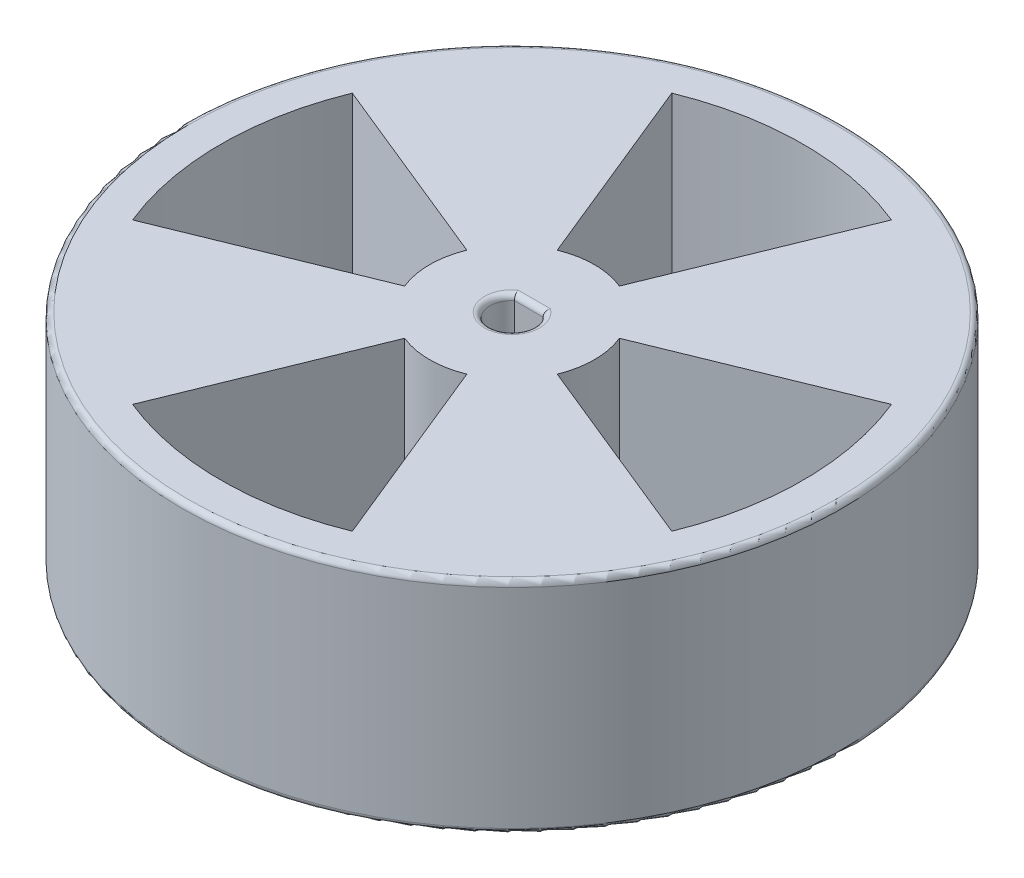
ISO-10303-21;
HEADER;
FILE_DESCRIPTION(('STEP AP214'),'2;1');
FILE_NAME('part.step','',(''),(''),'','','');
FILE_SCHEMA(('AUTOMOTIVE_DESIGN { 1 0 10303 214 1 1 1 1 }'));
ENDSEC;
DATA;
#1=APPLICATION_CONTEXT('core data for automotive mechanical design processes');
#2=APPLICATION_PROTOCOL_DEFINITION('international standard','automotive_design',2000,#1);
#3=PRODUCT_CONTEXT('',#1,'mechanical');
#4=PRODUCT('Part','Part','',(#3));
#5=PRODUCT_RELATED_PRODUCT_CATEGORY('part','',(#4));
#6=PRODUCT_DEFINITION_FORMATION('','',#4);
#7=PRODUCT_DEFINITION_CONTEXT('part definition',#1,'design');
#8=PRODUCT_DEFINITION('design','',#6,#7);
#9=PRODUCT_DEFINITION_SHAPE('','',#8);
#10=(LENGTH_UNIT() NAMED_UNIT(*) SI_UNIT(.MILLI.,.METRE.));
#11=(NAMED_UNIT(*) PLANE_ANGLE_UNIT() SI_UNIT($,.RADIAN.));
#12=(NAMED_UNIT(*) SI_UNIT($,.STERADIAN.) SOLID_ANGLE_UNIT());
#13=UNCERTAINTY_MEASURE_WITH_UNIT(LENGTH_MEASURE(1.E-05),#10,'distance_accuracy_value','');
#14=(GEOMETRIC_REPRESENTATION_CONTEXT(3) GLOBAL_UNCERTAINTY_ASSIGNED_CONTEXT((#13)) GLOBAL_UNIT_ASSIGNED_CONTEXT((#10,
#11,#12)) REPRESENTATION_CONTEXT('',''));
#15=CARTESIAN_POINT('',(0.,0.,0.));
#16=DIRECTION('',(0.,0.,1.));
#17=DIRECTION('',(1.,0.,0.));
#18=AXIS2_PLACEMENT_3D('',#15,#16,#17);
#19=CARTESIAN_POINT('',(0.,20.,0.));
#20=DIRECTION('',(0.,-1.,0.));
#21=DIRECTION('',(0.,0.,-1.));
#22=AXIS2_PLACEMENT_3D('',#19,#20,#21);
#23=CYLINDRICAL_SURFACE('',#22,2.);
#24=DIRECTION('',(0.,-1.,0.));
#25=VECTOR('',#24,1.);
#26=CARTESIAN_POINT('',(1.29999999999998,20.,-1.51986841535708));
#27=LINE('',#26,#25);
#28=CARTESIAN_POINT('',(1.29999999999998,19.5,-1.51986841535708));
#29=VERTEX_POINT('',#28);
#30=CARTESIAN_POINT('',(1.3,0.5,-1.51986841535706));
#31=VERTEX_POINT('',#30);
#32=EDGE_CURVE('E480',#29,#31,#27,.T.);
#33=ORIENTED_EDGE('',*,*,#32,.T.);
#34=CARTESIAN_POINT('',(0.,0.5,0.));
#35=DIRECTION('',(0.,1.,0.));
#36=DIRECTION('',(0.,0.,1.));
#37=AXIS2_PLACEMENT_3D('',#34,#35,#36);
#38=CIRCLE('',#37,2.);
#39=CARTESIAN_POINT('',(-1.3,0.5,-1.51986841535705));
#40=VERTEX_POINT('',#39);
#41=EDGE_CURVE('E14',#31,#40,#38,.F.);
#42=ORIENTED_EDGE('',*,*,#41,.T.);
#43=DIRECTION('',(0.,-1.,0.));
#44=VECTOR('',#43,1.);
#45=CARTESIAN_POINT('',(-1.30000000000002,20.,-1.51986841535706));
#46=LINE('',#45,#44);
#47=CARTESIAN_POINT('',(-1.30000000000002,19.5,-1.51986841535706));
#48=VERTEX_POINT('',#47);
#49=EDGE_CURVE('E484',#48,#40,#46,.T.);
#50=ORIENTED_EDGE('',*,*,#49,.F.);
#51=CARTESIAN_POINT('',(0.,19.5,0.));
#52=DIRECTION('',(0.,1.,0.));
#53=DIRECTION('',(0.,0.,1.));
#54=AXIS2_PLACEMENT_3D('',#51,#52,#53);
#55=CIRCLE('',#54,2.);
#56=EDGE_CURVE('E170',#48,#29,#55,.T.);
#57=ORIENTED_EDGE('',*,*,#56,.T.);
#58=EDGE_LOOP('',(#33,#42,#50,#57));
#59=FACE_BOUND('',#58,.T.);
#60=ADVANCED_FACE('F155',(#59),#23,.F.);
#61=CARTESIAN_POINT('',(0.,20.,-1.51986841535706));
#62=DIRECTION('',(0.,0.,-1.));
#63=DIRECTION('',(-1.,0.,0.));
#64=AXIS2_PLACEMENT_3D('',#61,#62,#63);
#65=PLANE('',#64);
#66=ORIENTED_EDGE('',*,*,#49,.T.);
#67=DIRECTION('',(1.,0.,0.));
#68=VECTOR('',#67,1.);
#69=CARTESIAN_POINT('',(0.,0.5,-1.51986841535705));
#70=LINE('',#69,#68);
#71=EDGE_CURVE('E522',#40,#31,#70,.T.);
#72=ORIENTED_EDGE('',*,*,#71,.T.);
#73=ORIENTED_EDGE('',*,*,#32,.F.);
#74=DIRECTION('',(1.,0.,0.));
#75=VECTOR('',#74,1.);
#76=CARTESIAN_POINT('',(-1.30000000000002,19.5,-1.51986841535706));
#77=LINE('',#76,#75);
#78=EDGE_CURVE('E519',#29,#48,#77,.F.);
#79=ORIENTED_EDGE('',*,*,#78,.T.);
#80=EDGE_LOOP('',(#66,#72,#73,#79));
#81=FACE_BOUND('',#80,.T.);
#82=ADVANCED_FACE('F585',(#81),#65,.F.);
#83=CARTESIAN_POINT('',(0.,20.,0.));
#84=DIRECTION('',(0.,-1.,0.));
#85=DIRECTION('',(0.,0.,-1.));
#86=AXIS2_PLACEMENT_3D('',#83,#84,#85);
#87=CYLINDRICAL_SURFACE('',#86,30.);
#88=CARTESIAN_POINT('',(0.,19.5,0.));
#89=DIRECTION('',(0.,1.,0.));
#90=DIRECTION('',(0.,0.,1.));
#91=AXIS2_PLACEMENT_3D('',#88,#89,#90);
#92=CIRCLE('',#91,30.);
#93=CARTESIAN_POINT('',(0.,19.5,30.));
#94=VERTEX_POINT('',#93);
#95=EDGE_CURVE('E504',#94,#94,#92,.F.);
#96=ORIENTED_EDGE('',*,*,#95,.T.);
#97=EDGE_LOOP('',(#96));
#98=FACE_BOUND('',#97,.T.);
#99=CARTESIAN_POINT('',(0.,0.5,0.));
#100=DIRECTION('',(0.,1.,0.));
#101=DIRECTION('',(0.,0.,1.));
#102=AXIS2_PLACEMENT_3D('',#99,#100,#101);
#103=CIRCLE('',#102,30.);
#104=CARTESIAN_POINT('',(0.,0.5,30.));
#105=VERTEX_POINT('',#104);
#106=EDGE_CURVE('E500',#105,#105,#103,.T.);
#107=ORIENTED_EDGE('',*,*,#106,.T.);
#108=EDGE_LOOP('',(#107));
#109=FACE_BOUND('',#108,.T.);
#110=ADVANCED_FACE('F575',(#98,#109),#87,.T.);
#111=CARTESIAN_POINT('',(0.,20.,0.));
#112=DIRECTION('',(0.,1.,0.));
#113=DIRECTION('',(0.,0.,1.));
#114=AXIS2_PLACEMENT_3D('',#111,#112,#113);
#115=PLANE('',#114);
#116=DIRECTION('',(-0.926067259759097,0.,-0.377358490566038));
#117=VECTOR('',#116,1.);
#118=CARTESIAN_POINT('',(0.,20.,0.));
#119=LINE('',#118,#117);
#120=CARTESIAN_POINT('',(-6.94550444819269,20.,-2.83018867924505));
#121=VERTEX_POINT('',#120);
#122=CARTESIAN_POINT('',(-24.5407823836161,20.,-9.99999999999998));
#123=VERTEX_POINT('',#122);
#124=EDGE_CURVE('E178',#121,#123,#119,.T.);
#125=ORIENTED_EDGE('',*,*,#124,.F.);
#126=CARTESIAN_POINT('',(0.,20.,0.));
#127=DIRECTION('',(0.,1.,0.));
#128=DIRECTION('',(0.,0.,1.));
#129=AXIS2_PLACEMENT_3D('',#126,#127,#128);
#130=CIRCLE('',#129,7.5);
#131=CARTESIAN_POINT('',(-6.94550444819269,20.,2.83018867924551));
#132=VERTEX_POINT('',#131);
#133=EDGE_CURVE('E359',#121,#132,#130,.T.);
#134=ORIENTED_EDGE('',*,*,#133,.T.);
#135=DIRECTION('',(0.926067259759097,0.,-0.377358490566038));
#136=VECTOR('',#135,1.);
#137=CARTESIAN_POINT('',(1.38777878078145E-13,20.,4.16333634234434E-13));
#138=LINE('',#137,#136);
#139=CARTESIAN_POINT('',(-24.5407823836155,20.,10.0000000000003));
#140=VERTEX_POINT('',#139);
#141=EDGE_CURVE('E378',#140,#132,#138,.T.);
#142=ORIENTED_EDGE('',*,*,#141,.F.);
#143=CARTESIAN_POINT('',(0.,20.,0.));
#144=DIRECTION('',(0.,1.,0.));
#145=DIRECTION('',(0.,0.,1.));
#146=AXIS2_PLACEMENT_3D('',#143,#144,#145);
#147=CIRCLE('',#146,26.5);
#148=EDGE_CURVE('E373',#123,#140,#147,.T.);
#149=ORIENTED_EDGE('',*,*,#148,.F.);
#150=EDGE_LOOP('',(#125,#134,#142,#149));
#151=FACE_BOUND('',#150,.T.);
#152=DIRECTION('',(0.926067259759097,0.,0.377358490566038));
#153=VECTOR('',#152,1.);
#154=CARTESIAN_POINT('',(2.08166817117217E-13,20.,-5.55111512312578E-13));
#155=LINE('',#154,#153);
#156=CARTESIAN_POINT('',(6.94550444819345,20.,2.83018867924473));
#157=VERTEX_POINT('',#156);
#158=CARTESIAN_POINT('',(24.5407823836163,20.,9.99999999999945));
#159=VERTEX_POINT('',#158);
#160=EDGE_CURVE('E186',#157,#159,#155,.T.);
#161=ORIENTED_EDGE('',*,*,#160,.F.);
#162=CARTESIAN_POINT('',(0.,20.,0.));
#163=DIRECTION('',(0.,1.,0.));
#164=DIRECTION('',(0.,0.,1.));
#165=AXIS2_PLACEMENT_3D('',#162,#163,#164);
#166=CIRCLE('',#165,7.5);
#167=CARTESIAN_POINT('',(6.94550444819345,20.,-2.83018867924585));
#168=VERTEX_POINT('',#167);
#169=EDGE_CURVE('E402',#157,#168,#166,.T.);
#170=ORIENTED_EDGE('',*,*,#169,.T.);
#171=DIRECTION('',(-0.926067259759097,0.,0.377358490566038));
#172=VECTOR('',#171,1.);
#173=CARTESIAN_POINT('',(-1.66533453693773E-13,20.,-3.88578058618805E-13));
#174=LINE('',#173,#172);
#175=CARTESIAN_POINT('',(24.5407823836163,20.,-10.0000000000006));
#176=VERTEX_POINT('',#175);
#177=EDGE_CURVE('E420',#176,#168,#174,.T.);
#178=ORIENTED_EDGE('',*,*,#177,.F.);
#179=CARTESIAN_POINT('',(0.,20.,0.));
#180=DIRECTION('',(0.,1.,0.));
#181=DIRECTION('',(0.,0.,1.));
#182=AXIS2_PLACEMENT_3D('',#179,#180,#181);
#183=CIRCLE('',#182,26.5);
#184=EDGE_CURVE('E416',#159,#176,#183,.T.);
#185=ORIENTED_EDGE('',*,*,#184,.F.);
#186=EDGE_LOOP('',(#161,#170,#178,#185));
#187=FACE_BOUND('',#186,.T.);
#188=DIRECTION('',(-0.377358490566038,0.,0.926067259759097));
#189=VECTOR('',#188,1.);
#190=CARTESIAN_POINT('',(5.62050406216485E-13,20.,2.28983498828939E-13));
#191=LINE('',#190,#189);
#192=CARTESIAN_POINT('',(-2.83018867924451,20.,6.9455044481929));
#193=VERTEX_POINT('',#192);
#194=CARTESIAN_POINT('',(-9.99999999999947,20.,24.5407823836163));
#195=VERTEX_POINT('',#194);
#196=EDGE_CURVE('E306',#193,#195,#191,.T.);
#197=ORIENTED_EDGE('',*,*,#196,.F.);
#198=CARTESIAN_POINT('',(0.,20.,0.));
#199=DIRECTION('',(0.,1.,0.));
#200=DIRECTION('',(0.,0.,1.));
#201=AXIS2_PLACEMENT_3D('',#198,#199,#200);
#202=CIRCLE('',#201,7.5);
#203=CARTESIAN_POINT('',(2.83018867924607,20.,6.9455044481929));
#204=VERTEX_POINT('',#203);
#205=EDGE_CURVE('E326',#193,#204,#202,.T.);
#206=ORIENTED_EDGE('',*,*,#205,.T.);
#207=DIRECTION('',(-0.377358490566038,0.,-0.926067259759097));
#208=VECTOR('',#207,1.);
#209=CARTESIAN_POINT('',(7.70217223333702E-13,20.,-3.19189119579733E-13));
#210=LINE('',#209,#208);
#211=CARTESIAN_POINT('',(10.0000000000008,20.,24.5407823836157));
#212=VERTEX_POINT('',#211);
#213=EDGE_CURVE('E331',#212,#204,#210,.T.);
#214=ORIENTED_EDGE('',*,*,#213,.F.);
#215=CARTESIAN_POINT('',(0.,20.,0.));
#216=DIRECTION('',(0.,1.,0.));
#217=DIRECTION('',(0.,0.,1.));
#218=AXIS2_PLACEMENT_3D('',#215,#216,#217);
#219=CIRCLE('',#218,26.5);
#220=EDGE_CURVE('E340',#195,#212,#219,.T.);
#221=ORIENTED_EDGE('',*,*,#220,.F.);
#222=EDGE_LOOP('',(#197,#206,#214,#221));
#223=FACE_BOUND('',#222,.T.);
#224=DIRECTION('',(0.377358490566038,0.,-0.926067259759097));
#225=VECTOR('',#224,1.);
#226=CARTESIAN_POINT('',(0.,20.,0.));
#227=LINE('',#226,#225);
#228=CARTESIAN_POINT('',(2.83018867924528,20.,-6.94550444819322));
#229=VERTEX_POINT('',#228);
#230=CARTESIAN_POINT('',(10.,20.,-24.5407823836161));
#231=VERTEX_POINT('',#230);
#232=EDGE_CURVE('E388',#229,#231,#227,.T.);
#233=ORIENTED_EDGE('',*,*,#232,.F.);
#234=CARTESIAN_POINT('',(0.,20.,0.));
#235=DIRECTION('',(0.,1.,0.));
#236=DIRECTION('',(0.,0.,1.));
#237=AXIS2_PLACEMENT_3D('',#234,#235,#236);
#238=CIRCLE('',#237,7.5);
#239=CARTESIAN_POINT('',(-2.83018867924531,20.,-6.94550444819322));
#240=VERTEX_POINT('',#239);
#241=EDGE_CURVE('E442',#229,#240,#238,.T.);
#242=ORIENTED_EDGE('',*,*,#241,.T.);
#243=DIRECTION('',(0.377358490566038,0.,0.926067259759097));
#244=VECTOR('',#243,1.);
#245=CARTESIAN_POINT('',(0.,20.,0.));
#246=LINE('',#245,#244);
#247=CARTESIAN_POINT('',(-10.,20.,-24.5407823836161));
#248=VERTEX_POINT('',#247);
#249=EDGE_CURVE('E460',#248,#240,#246,.T.);
#250=ORIENTED_EDGE('',*,*,#249,.F.);
#251=CARTESIAN_POINT('',(0.,20.,0.));
#252=DIRECTION('',(0.,1.,0.));
#253=DIRECTION('',(0.,0.,1.));
#254=AXIS2_PLACEMENT_3D('',#251,#252,#253);
#255=CIRCLE('',#254,26.5);
#256=EDGE_CURVE('E456',#231,#248,#255,.T.);
#257=ORIENTED_EDGE('',*,*,#256,.F.);
#258=EDGE_LOOP('',(#233,#242,#250,#257));
#259=FACE_BOUND('',#258,.T.);
#260=CARTESIAN_POINT('',(0.,20.,0.));
#261=DIRECTION('',(0.,1.,0.));
#262=DIRECTION('',(0.,0.,1.));
#263=AXIS2_PLACEMENT_3D('',#260,#261,#262);
#264=CIRCLE('',#263,29.5);
#265=CARTESIAN_POINT('',(0.,20.,29.5));
#266=VERTEX_POINT('',#265);
#267=EDGE_CURVE('E496',#266,#266,#264,.T.);
#268=ORIENTED_EDGE('',*,*,#267,.T.);
#269=EDGE_LOOP('',(#268));
#270=FACE_BOUND('',#269,.T.);
#271=DIRECTION('',(1.,0.,0.));
#272=VECTOR('',#271,1.);
#273=CARTESIAN_POINT('',(1.29999999999998,20.,-2.01986841535706));
#274=LINE('',#273,#272);
#275=CARTESIAN_POINT('',(-1.47313664832661,20.,-2.01986841535708));
#276=VERTEX_POINT('',#275);
#277=CARTESIAN_POINT('',(1.47313664832659,20.,-2.01986841535706));
#278=VERTEX_POINT('',#277);
#279=EDGE_CURVE('E489',#276,#278,#274,.T.);
#280=ORIENTED_EDGE('',*,*,#279,.T.);
#281=CARTESIAN_POINT('',(0.,20.,0.));
#282=DIRECTION('',(0.,1.,0.));
#283=DIRECTION('',(0.,0.,1.));
#284=AXIS2_PLACEMENT_3D('',#281,#282,#283);
#285=CIRCLE('',#284,2.5);
#286=EDGE_CURVE('E492',#278,#276,#285,.F.);
#287=ORIENTED_EDGE('',*,*,#286,.T.);
#288=EDGE_LOOP('',(#280,#287));
#289=FACE_BOUND('',#288,.T.);
#290=ADVANCED_FACE('F573',(#151,#187,#223,#259,#270,#289),#115,.T.);
#291=CARTESIAN_POINT('',(0.,0.,0.));
#292=DIRECTION('',(0.,1.,0.));
#293=DIRECTION('',(0.,0.,1.));
#294=AXIS2_PLACEMENT_3D('',#291,#292,#293);
#295=PLANE('',#294);
#296=CARTESIAN_POINT('',(0.,0.,0.));
#297=DIRECTION('',(0.,1.,0.));
#298=DIRECTION('',(0.,0.,1.));
#299=AXIS2_PLACEMENT_3D('',#296,#297,#298);
#300=CIRCLE('',#299,7.5);
#301=CARTESIAN_POINT('',(-6.94550444819267,0.,-2.83018867924505));
#302=VERTEX_POINT('',#301);
#303=CARTESIAN_POINT('',(-6.94550444819267,0.,2.83018867924552));
#304=VERTEX_POINT('',#303);
#305=EDGE_CURVE('E367',#302,#304,#300,.T.);
#306=ORIENTED_EDGE('',*,*,#305,.F.);
#307=DIRECTION('',(-0.926067259759097,0.,-0.377358490566038));
#308=VECTOR('',#307,1.);
#309=CARTESIAN_POINT('',(0.,0.,0.));
#310=LINE('',#309,#308);
#311=CARTESIAN_POINT('',(-24.5407823836155,0.,-9.99999999999978));
#312=VERTEX_POINT('',#311);
#313=EDGE_CURVE('E354',#302,#312,#310,.T.);
#314=ORIENTED_EDGE('',*,*,#313,.T.);
#315=CARTESIAN_POINT('',(0.,0.,0.));
#316=DIRECTION('',(0.,1.,0.));
#317=DIRECTION('',(0.,0.,1.));
#318=AXIS2_PLACEMENT_3D('',#315,#316,#317);
#319=CIRCLE('',#318,26.5);
#320=CARTESIAN_POINT('',(-24.5407823836159,0.,10.0000000000004));
#321=VERTEX_POINT('',#320);
#322=EDGE_CURVE('E358',#312,#321,#319,.T.);
#323=ORIENTED_EDGE('',*,*,#322,.T.);
#324=DIRECTION('',(0.926067259759097,0.,-0.377358490566038));
#325=VECTOR('',#324,1.);
#326=CARTESIAN_POINT('',(1.52655665885959E-13,0.,4.09394740330526E-13));
#327=LINE('',#326,#325);
#328=EDGE_CURVE('E363',#321,#304,#327,.T.);
#329=ORIENTED_EDGE('',*,*,#328,.T.);
#330=EDGE_LOOP('',(#306,#314,#323,#329));
#331=FACE_BOUND('',#330,.T.);
#332=CARTESIAN_POINT('',(0.,0.,0.));
#333=DIRECTION('',(0.,1.,0.));
#334=DIRECTION('',(0.,0.,1.));
#335=AXIS2_PLACEMENT_3D('',#332,#333,#334);
#336=CIRCLE('',#335,7.5);
#337=CARTESIAN_POINT('',(6.94550444819345,0.,2.83018867924473));
#338=VERTEX_POINT('',#337);
#339=CARTESIAN_POINT('',(6.94550444819345,0.,-2.83018867924585));
#340=VERTEX_POINT('',#339);
#341=EDGE_CURVE('E410',#338,#340,#336,.T.);
#342=ORIENTED_EDGE('',*,*,#341,.F.);
#343=DIRECTION('',(0.926067259759097,0.,0.377358490566038));
#344=VECTOR('',#343,1.);
#345=CARTESIAN_POINT('',(2.28983498828939E-13,0.,-5.48172618408671E-13));
#346=LINE('',#345,#344);
#347=CARTESIAN_POINT('',(24.5407823836163,0.,9.99999999999944));
#348=VERTEX_POINT('',#347);
#349=EDGE_CURVE('E397',#338,#348,#346,.T.);
#350=ORIENTED_EDGE('',*,*,#349,.T.);
#351=CARTESIAN_POINT('',(0.,0.,0.));
#352=DIRECTION('',(0.,1.,0.));
#353=DIRECTION('',(0.,0.,1.));
#354=AXIS2_PLACEMENT_3D('',#351,#352,#353);
#355=CIRCLE('',#354,26.5);
#356=CARTESIAN_POINT('',(24.5407823836159,0.,-10.0000000000004));
#357=VERTEX_POINT('',#356);
#358=EDGE_CURVE('E401',#348,#357,#355,.T.);
#359=ORIENTED_EDGE('',*,*,#358,.T.);
#360=DIRECTION('',(-0.926067259759097,0.,0.377358490566038));
#361=VECTOR('',#360,1.);
#362=CARTESIAN_POINT('',(-1.52655665885959E-13,0.,-3.88578058618805E-13));
#363=LINE('',#362,#361);
#364=EDGE_CURVE('E406',#357,#340,#363,.T.);
#365=ORIENTED_EDGE('',*,*,#364,.T.);
#366=EDGE_LOOP('',(#342,#350,#359,#365));
#367=FACE_BOUND('',#366,.T.);
#368=CARTESIAN_POINT('',(0.,0.,0.));
#369=DIRECTION('',(0.,1.,0.));
#370=DIRECTION('',(0.,0.,1.));
#371=AXIS2_PLACEMENT_3D('',#368,#369,#370);
#372=CIRCLE('',#371,7.5);
#373=CARTESIAN_POINT('',(-2.8301886792445,0.,6.94550444819289));
#374=VERTEX_POINT('',#373);
#375=CARTESIAN_POINT('',(2.83018867924608,0.,6.9455044481929));
#376=VERTEX_POINT('',#375);
#377=EDGE_CURVE('E312',#374,#376,#372,.T.);
#378=ORIENTED_EDGE('',*,*,#377,.F.);
#379=DIRECTION('',(-0.377358490566038,0.,0.926067259759097));
#380=VECTOR('',#379,1.);
#381=CARTESIAN_POINT('',(5.68989300120393E-13,0.,2.28983498828939E-13));
#382=LINE('',#381,#380);
#383=CARTESIAN_POINT('',(-9.99999999999923,0.,24.5407823836158));
#384=VERTEX_POINT('',#383);
#385=EDGE_CURVE('E303',#374,#384,#382,.T.);
#386=ORIENTED_EDGE('',*,*,#385,.T.);
#387=CARTESIAN_POINT('',(0.,0.,0.));
#388=DIRECTION('',(0.,1.,0.));
#389=DIRECTION('',(0.,0.,1.));
#390=AXIS2_PLACEMENT_3D('',#387,#388,#389);
#391=CIRCLE('',#390,26.5);
#392=CARTESIAN_POINT('',(10.0000000000008,0.,24.5407823836157));
#393=VERTEX_POINT('',#392);
#394=EDGE_CURVE('E316',#384,#393,#391,.T.);
#395=ORIENTED_EDGE('',*,*,#394,.T.);
#396=DIRECTION('',(-0.377358490566038,0.,-0.926067259759097));
#397=VECTOR('',#396,1.);
#398=CARTESIAN_POINT('',(7.91033905045424E-13,0.,-3.19189119579733E-13));
#399=LINE('',#398,#397);
#400=EDGE_CURVE('E321',#393,#376,#399,.T.);
#401=ORIENTED_EDGE('',*,*,#400,.T.);
#402=EDGE_LOOP('',(#378,#386,#395,#401));
#403=FACE_BOUND('',#402,.T.);
#404=CARTESIAN_POINT('',(0.,0.,0.));
#405=DIRECTION('',(0.,1.,0.));
#406=DIRECTION('',(0.,0.,1.));
#407=AXIS2_PLACEMENT_3D('',#404,#405,#406);
#408=CIRCLE('',#407,7.5);
#409=CARTESIAN_POINT('',(2.83018867924528,0.,-6.94550444819322));
#410=VERTEX_POINT('',#409);
#411=CARTESIAN_POINT('',(-2.83018867924529,0.,-6.94550444819321));
#412=VERTEX_POINT('',#411);
#413=EDGE_CURVE('E450',#410,#412,#408,.T.);
#414=ORIENTED_EDGE('',*,*,#413,.F.);
#415=DIRECTION('',(0.377358490566038,0.,-0.926067259759097));
#416=VECTOR('',#415,1.);
#417=CARTESIAN_POINT('',(0.,0.,0.));
#418=LINE('',#417,#416);
#419=CARTESIAN_POINT('',(10.,0.,-24.5407823836161));
#420=VERTEX_POINT('',#419);
#421=EDGE_CURVE('E437',#410,#420,#418,.T.);
#422=ORIENTED_EDGE('',*,*,#421,.T.);
#423=CARTESIAN_POINT('',(0.,0.,0.));
#424=DIRECTION('',(0.,1.,0.));
#425=DIRECTION('',(0.,0.,1.));
#426=AXIS2_PLACEMENT_3D('',#423,#424,#425);
#427=CIRCLE('',#426,26.5);
#428=CARTESIAN_POINT('',(-10.,0.,-24.5407823836161));
#429=VERTEX_POINT('',#428);
#430=EDGE_CURVE('E441',#420,#429,#427,.T.);
#431=ORIENTED_EDGE('',*,*,#430,.T.);
#432=DIRECTION('',(0.377358490566038,0.,0.926067259759097));
#433=VECTOR('',#432,1.);
#434=CARTESIAN_POINT('',(0.,0.,0.));
#435=LINE('',#434,#433);
#436=EDGE_CURVE('E446',#429,#412,#435,.T.);
#437=ORIENTED_EDGE('',*,*,#436,.T.);
#438=EDGE_LOOP('',(#414,#422,#431,#437));
#439=FACE_BOUND('',#438,.T.);
#440=CARTESIAN_POINT('',(0.,0.,0.));
#441=DIRECTION('',(0.,1.,0.));
#442=DIRECTION('',(0.,0.,1.));
#443=AXIS2_PLACEMENT_3D('',#440,#441,#442);
#444=CIRCLE('',#443,29.5);
#445=CARTESIAN_POINT('',(0.,0.,29.5));
#446=VERTEX_POINT('',#445);
#447=EDGE_CURVE('E515',#446,#446,#444,.F.);
#448=ORIENTED_EDGE('',*,*,#447,.T.);
#449=EDGE_LOOP('',(#448));
#450=FACE_BOUND('',#449,.T.);
#451=CARTESIAN_POINT('',(0.,0.,0.));
#452=DIRECTION('',(0.,1.,0.));
#453=DIRECTION('',(0.,0.,1.));
#454=AXIS2_PLACEMENT_3D('',#451,#452,#453);
#455=CIRCLE('',#454,2.5);
#456=CARTESIAN_POINT('',(-1.47313664832659,0.,-2.01986841535707));
#457=VERTEX_POINT('',#456);
#458=CARTESIAN_POINT('',(1.4731366483266,0.,-2.01986841535706));
#459=VERTEX_POINT('',#458);
#460=EDGE_CURVE('E508',#457,#459,#455,.T.);
#461=ORIENTED_EDGE('',*,*,#460,.T.);
#462=DIRECTION('',(1.,0.,0.));
#463=VECTOR('',#462,1.);
#464=CARTESIAN_POINT('',(0.,0.,-2.01986841535704));
#465=LINE('',#464,#463);
#466=EDGE_CURVE('E511',#459,#457,#465,.F.);
#467=ORIENTED_EDGE('',*,*,#466,.T.);
#468=EDGE_LOOP('',(#461,#467));
#469=FACE_BOUND('',#468,.T.);
#470=ADVANCED_FACE('F323',(#331,#367,#403,#439,#450,#469),#295,.F.);
#471=CARTESIAN_POINT('',(0.,19.5,0.));
#472=DIRECTION('',(0.,1.,0.));
#473=DIRECTION('',(0.,0.,1.));
#474=AXIS2_PLACEMENT_3D('',#471,#472,#473);
#475=TOROIDAL_SURFACE('',#474,29.5,0.5);
#476=ORIENTED_EDGE('',*,*,#95,.F.);
#477=EDGE_LOOP('',(#476));
#478=FACE_BOUND('',#477,.T.);
#479=ORIENTED_EDGE('',*,*,#267,.F.);
#480=EDGE_LOOP('',(#479));
#481=FACE_BOUND('',#480,.T.);
#482=ADVANCED_FACE('F582',(#478,#481),#475,.T.);
#483=CARTESIAN_POINT('',(0.,0.5,0.));
#484=DIRECTION('',(0.,1.,0.));
#485=DIRECTION('',(0.,0.,1.));
#486=AXIS2_PLACEMENT_3D('',#483,#484,#485);
#487=TOROIDAL_SURFACE('',#486,29.5,0.5);
#488=ORIENTED_EDGE('',*,*,#447,.F.);
#489=EDGE_LOOP('',(#488));
#490=FACE_BOUND('',#489,.T.);
#491=ORIENTED_EDGE('',*,*,#106,.F.);
#492=EDGE_LOOP('',(#491));
#493=FACE_BOUND('',#492,.T.);
#494=ADVANCED_FACE('F548',(#490,#493),#487,.T.);
#495=CARTESIAN_POINT('',(0.,0.5,0.));
#496=DIRECTION('',(0.,1.,0.));
#497=DIRECTION('',(0.,0.,1.));
#498=AXIS2_PLACEMENT_3D('',#495,#496,#497);
#499=TOROIDAL_SURFACE('',#498,2.5,0.5);
#500=CARTESIAN_POINT('',(1.3,0.5,-1.51986841535706));
#501=CARTESIAN_POINT('',(1.29998655889667,0.473078205526581,-1.51983959791094));
#502=CARTESIAN_POINT('',(1.30080232162127,0.44617494078572,-1.522040769694));
#503=CARTESIAN_POINT('',(1.30398769312894,0.393219252864169,-1.53067740859785));
#504=CARTESIAN_POINT('',(1.30635333311832,0.367164834434711,-1.53710206073221));
#505=CARTESIAN_POINT('',(1.31253423878328,0.316580790323173,-1.55396034257154));
#506=CARTESIAN_POINT('',(1.31634921182469,0.292050857995419,-1.56439316299387));
#507=CARTESIAN_POINT('',(1.32525480070926,0.245128769621593,-1.58889158054112));
#508=CARTESIAN_POINT('',(1.33034582056662,0.22273729374739,-1.60295832826141));
#509=CARTESIAN_POINT('',(1.34175743686311,0.180028004526673,-1.63471163909692));
#510=CARTESIAN_POINT('',(1.34810827693293,0.159785129811702,-1.65248794957925));
#511=CARTESIAN_POINT('',(1.36170933662044,0.12254096604634,-1.69086955376595));
#512=CARTESIAN_POINT('',(1.36895987686877,0.105540838137507,-1.71147585628964));
#513=CARTESIAN_POINT('',(1.3845619172227,0.074241587561317,-1.75620724749611));
#514=CARTESIAN_POINT('',(1.39295275176782,0.0601540028383538,-1.7804665425869));
#515=CARTESIAN_POINT('',(1.41021335489358,0.0362648547196923,-1.83085329612076));
#516=CARTESIAN_POINT('',(1.41908311278975,0.0264631957522063,-1.85698071289151));
#517=CARTESIAN_POINT('',(1.43521568399087,0.0128793330672515,-1.90496355075246));
#518=CARTESIAN_POINT('',(1.44243813733972,0.00827802165796158,-1.92660614824529));
#519=CARTESIAN_POINT('',(1.45690066930131,0.00197865113641585,-1.97027358229288));
#520=CARTESIAN_POINT('',(1.46414068747817,0.000275036617940668,-1.99229760546788));
#521=CARTESIAN_POINT('',(1.47193278884479,1.02024639586266E-05,-2.01617586487223));
#522=CARTESIAN_POINT('',(1.47253491498101,-2.71368579756796E-08,-2.01802217189181));
#523=CARTESIAN_POINT('',(1.4731366483266,0.,-2.01986841535706));
#524=B_SPLINE_CURVE_WITH_KNOTS('',3,(#500,#501,#502,#503,#504,#505,#506,#507,#508,#509,#510,
#511,#512,#513,#514,#515,#516,#517,#518,#519,#520,#521,#522,#523),.UNSPECIFIED.,.F.,.F.,(4,2,2,
2,2,2,2,2,2,2,2,4),(0.,0.0806345716265585,0.161063463934888,0.241476125505805,0.321914279077932,
0.404588268762403,0.48729180646398,0.574751214468514,0.662208672117686,0.731866068390161,
0.801389767745992,0.807215754781893),.UNSPECIFIED.);
#525=EDGE_CURVE('E529',#459,#31,#524,.F.);
#526=ORIENTED_EDGE('',*,*,#525,.F.);
#527=ORIENTED_EDGE('',*,*,#460,.F.);
#528=CARTESIAN_POINT('',(-1.3,0.5,-1.51986841535705));
#529=CARTESIAN_POINT('',(-1.29998655889666,0.473078205526582,-1.51983959791094));
#530=CARTESIAN_POINT('',(-1.30080232162127,0.446174940785721,-1.522040769694));
#531=CARTESIAN_POINT('',(-1.30398769312894,0.393219252864171,-1.53067740859785));
#532=CARTESIAN_POINT('',(-1.30635333311832,0.367164834434711,-1.53710206073221));
#533=CARTESIAN_POINT('',(-1.31253423878329,0.316580790323174,-1.55396034257154));
#534=CARTESIAN_POINT('',(-1.31634921182469,0.292050857995421,-1.56439316299388));
#535=CARTESIAN_POINT('',(-1.32525480070926,0.245128769621594,-1.58889158054111));
#536=CARTESIAN_POINT('',(-1.33034582056662,0.222737293747389,-1.60295832826139));
#537=CARTESIAN_POINT('',(-1.34175743686311,0.180028004526672,-1.63471163909691));
#538=CARTESIAN_POINT('',(-1.34810827693292,0.159785129811705,-1.65248794957924));
#539=CARTESIAN_POINT('',(-1.36170933662044,0.122540966046344,-1.69086955376595));
#540=CARTESIAN_POINT('',(-1.36895987686879,0.105540838137508,-1.71147585628963));
#541=CARTESIAN_POINT('',(-1.38456191722271,0.0742415875613168,-1.7562072474961));
#542=CARTESIAN_POINT('',(-1.39295275176782,0.0601540028383547,-1.7804665425869));
#543=CARTESIAN_POINT('',(-1.41021335489357,0.0362648547196932,-1.83085329612076));
#544=CARTESIAN_POINT('',(-1.41908311278976,0.0264631957522062,-1.8569807128915));
#545=CARTESIAN_POINT('',(-1.43521568399087,0.0128793330672518,-1.90496355075245));
#546=CARTESIAN_POINT('',(-1.4424381373397,0.00827802165796273,-1.92660614824529));
#547=CARTESIAN_POINT('',(-1.45690066930132,0.00197865113641691,-1.97027358229287));
#548=CARTESIAN_POINT('',(-1.46414068747823,0.000275036617940749,-1.99229760546785));
#549=CARTESIAN_POINT('',(-1.47193278884479,1.02024639585604E-05,-2.01617586487222));
#550=CARTESIAN_POINT('',(-1.47253491498101,-2.71368580422417E-08,-2.01802217189181));
#551=CARTESIAN_POINT('',(-1.47313664832659,0.,-2.01986841535707));
#552=B_SPLINE_CURVE_WITH_KNOTS('',3,(#528,#529,#530,#531,#532,#533,#534,#535,#536,#537,#538,
#539,#540,#541,#542,#543,#544,#545,#546,#547,#548,#549,#550,#551),.UNSPECIFIED.,.F.,.F.,(4,2,2,
2,2,2,2,2,2,2,2,4),(0.,0.0806345716265571,0.161063463934889,0.241476125505803,0.321914279077926,
0.4045882687624,0.487291806463981,0.574751214468514,0.662208672117684,0.731866068390155,
0.801389767745982,0.8072157547819),.UNSPECIFIED.);
#553=EDGE_CURVE('E485',#40,#457,#552,.T.);
#554=ORIENTED_EDGE('',*,*,#553,.F.);
#555=ORIENTED_EDGE('',*,*,#41,.F.);
#556=EDGE_LOOP('',(#526,#527,#554,#555));
#557=FACE_BOUND('',#556,.T.);
#558=ADVANCED_FACE('F545',(#557),#499,.T.);
#559=CARTESIAN_POINT('',(0.,0.5,-2.01986841535704));
#560=DIRECTION('',(1.,0.,0.));
#561=DIRECTION('',(0.,0.,-1.));
#562=AXIS2_PLACEMENT_3D('',#559,#560,#561);
#563=CYLINDRICAL_SURFACE('',#562,0.5);
#564=ORIENTED_EDGE('',*,*,#553,.T.);
#565=ORIENTED_EDGE('',*,*,#466,.F.);
#566=ORIENTED_EDGE('',*,*,#525,.T.);
#567=ORIENTED_EDGE('',*,*,#71,.F.);
#568=EDGE_LOOP('',(#564,#565,#566,#567));
#569=FACE_BOUND('',#568,.T.);
#570=ADVANCED_FACE('F542',(#569),#563,.T.);
#571=CARTESIAN_POINT('',(0.,19.5,-2.01986841535706));
#572=DIRECTION('',(-1.,0.,0.));
#573=DIRECTION('',(0.,0.,1.));
#574=AXIS2_PLACEMENT_3D('',#571,#572,#573);
#575=CYLINDRICAL_SURFACE('',#574,0.5);
#576=CARTESIAN_POINT('',(1.29999999999998,19.5,-1.51986841535708));
#577=CARTESIAN_POINT('',(1.29998655889661,19.5269217944734,-1.51983959791095));
#578=CARTESIAN_POINT('',(1.30080232162121,19.5538250592143,-1.52204076969401));
#579=CARTESIAN_POINT('',(1.3039876931289,19.6067807471358,-1.53067740859786));
#580=CARTESIAN_POINT('',(1.3063533331183,19.6328351655653,-1.53710206073223));
#581=CARTESIAN_POINT('',(1.31253423878326,19.6834192096768,-1.55396034257155));
#582=CARTESIAN_POINT('',(1.31634921182464,19.7079491420046,-1.56439316299387));
#583=CARTESIAN_POINT('',(1.3252548007092,19.7548712303784,-1.5888915805411));
#584=CARTESIAN_POINT('',(1.33034582056659,19.7772627062526,-1.60295832826139));
#585=CARTESIAN_POINT('',(1.34175743686308,19.8199719954733,-1.63471163909691));
#586=CARTESIAN_POINT('',(1.34810827693287,19.8402148701883,-1.65248794957923));
#587=CARTESIAN_POINT('',(1.36170933662039,19.8774590339537,-1.69086955376594));
#588=CARTESIAN_POINT('',(1.36895987686875,19.8944591618625,-1.71147585628962));
#589=CARTESIAN_POINT('',(1.38456191722269,19.9257584124387,-1.75620724749611));
#590=CARTESIAN_POINT('',(1.39295275176778,19.9398459971617,-1.78046654258691));
#591=CARTESIAN_POINT('',(1.41021335489352,19.9637351452803,-1.83085329612078));
#592=CARTESIAN_POINT('',(1.41908311278972,19.9735368042478,-1.85698071289152));
#593=CARTESIAN_POINT('',(1.43521568399086,19.9871206669328,-1.90496355075246));
#594=CARTESIAN_POINT('',(1.44243813733969,19.9917219783421,-1.92660614824529));
#595=CARTESIAN_POINT('',(1.45690066930123,19.9980213488636,-1.9702735822929));
#596=CARTESIAN_POINT('',(1.46414068747805,19.999724963382,-1.99229760546791));
#597=CARTESIAN_POINT('',(1.47193278884476,19.999989797536,-2.01617586487223));
#598=CARTESIAN_POINT('',(1.47253491498099,20.0000000271369,-2.01802217189182));
#599=CARTESIAN_POINT('',(1.47313664832659,20.,-2.01986841535706));
#600=B_SPLINE_CURVE_WITH_KNOTS('',3,(#576,#577,#578,#579,#580,#581,#582,#583,#584,#585,#586,
#587,#588,#589,#590,#591,#592,#593,#594,#595,#596,#597,#598,#599),.UNSPECIFIED.,.F.,.F.,(4,2,2,
2,2,2,2,2,2,2,2,4),(0.,0.0806345716265266,0.161063463934834,0.241476125505749,0.32191427907787,
0.404588268762351,0.487291806463949,0.574751214468508,0.662208672117676,0.731866068390133,
0.801389767745973,0.807215754781876),.UNSPECIFIED.);
#601=EDGE_CURVE('E470',#278,#29,#600,.F.);
#602=ORIENTED_EDGE('',*,*,#601,.F.);
#603=ORIENTED_EDGE('',*,*,#279,.F.);
#604=CARTESIAN_POINT('',(-1.30000000000002,19.5,-1.51986841535706));
#605=CARTESIAN_POINT('',(-1.29998655889665,19.5269217944734,-1.51983959791095));
#606=CARTESIAN_POINT('',(-1.30080232162125,19.5538250592143,-1.52204076969401));
#607=CARTESIAN_POINT('',(-1.30398769312894,19.6067807471358,-1.53067740859785));
#608=CARTESIAN_POINT('',(-1.30635333311835,19.6328351655653,-1.53710206073222));
#609=CARTESIAN_POINT('',(-1.3125342387833,19.6834192096768,-1.55396034257154));
#610=CARTESIAN_POINT('',(-1.31634921182468,19.7079491420046,-1.56439316299387));
#611=CARTESIAN_POINT('',(-1.32525480070925,19.7548712303784,-1.5888915805411));
#612=CARTESIAN_POINT('',(-1.33034582056665,19.7772627062526,-1.6029583282614));
#613=CARTESIAN_POINT('',(-1.34175743686314,19.8199719954733,-1.63471163909691));
#614=CARTESIAN_POINT('',(-1.34810827693291,19.8402148701883,-1.65248794957923));
#615=CARTESIAN_POINT('',(-1.36170933662043,19.8774590339537,-1.69086955376595));
#616=CARTESIAN_POINT('',(-1.36895987686879,19.8944591618625,-1.71147585628964));
#617=CARTESIAN_POINT('',(-1.38456191722273,19.9257584124387,-1.75620724749612));
#618=CARTESIAN_POINT('',(-1.39295275176782,19.9398459971617,-1.78046654258691));
#619=CARTESIAN_POINT('',(-1.41021335489357,19.9637351452803,-1.83085329612078));
#620=CARTESIAN_POINT('',(-1.41908311278977,19.9735368042478,-1.85698071289152));
#621=CARTESIAN_POINT('',(-1.43521568399089,19.9871206669328,-1.90496355075246));
#622=CARTESIAN_POINT('',(-1.4424381373397,19.9917219783421,-1.9266061482453));
#623=CARTESIAN_POINT('',(-1.45690066930131,19.9980213488636,-1.97027358229289));
#624=CARTESIAN_POINT('',(-1.46414068747822,19.999724963382,-1.99229760546787));
#625=CARTESIAN_POINT('',(-1.47193278884481,19.999989797536,-2.01617586487224));
#626=CARTESIAN_POINT('',(-1.47253491498103,20.0000000271369,-2.01802217189183));
#627=CARTESIAN_POINT('',(-1.47313664832661,20.,-2.01986841535708));
#628=B_SPLINE_CURVE_WITH_KNOTS('',3,(#604,#605,#606,#607,#608,#609,#610,#611,#612,#613,#614,
#615,#616,#617,#618,#619,#620,#621,#622,#623,#624,#625,#626,#627),.UNSPECIFIED.,.F.,.F.,(4,2,2,
2,2,2,2,2,2,2,2,4),(0.,0.0806345716265311,0.161063463934834,0.241476125505755,0.321914279077875,
0.404588268762362,0.487291806463961,0.574751214468512,0.662208672117669,0.731866068390133,
0.801389767745978,0.807215754781884),.UNSPECIFIED.);
#629=EDGE_CURVE('E160',#48,#276,#628,.T.);
#630=ORIENTED_EDGE('',*,*,#629,.F.);
#631=ORIENTED_EDGE('',*,*,#78,.F.);
#632=EDGE_LOOP('',(#602,#603,#630,#631));
#633=FACE_BOUND('',#632,.T.);
#634=ADVANCED_FACE('F157',(#633),#575,.T.);
#635=CARTESIAN_POINT('',(0.,19.5,0.));
#636=DIRECTION('',(0.,1.,0.));
#637=DIRECTION('',(0.,0.,1.));
#638=AXIS2_PLACEMENT_3D('',#635,#636,#637);
#639=TOROIDAL_SURFACE('',#638,2.5,0.5);
#640=ORIENTED_EDGE('',*,*,#629,.T.);
#641=ORIENTED_EDGE('',*,*,#286,.F.);
#642=ORIENTED_EDGE('',*,*,#601,.T.);
#643=ORIENTED_EDGE('',*,*,#56,.F.);
#644=EDGE_LOOP('',(#640,#641,#642,#643));
#645=FACE_BOUND('',#644,.T.);
#646=ADVANCED_FACE('F550',(#645),#639,.T.);
#647=CARTESIAN_POINT('',(0.,0.,0.));
#648=DIRECTION('',(0.926067259759097,0.,0.377358490566038));
#649=DIRECTION('',(0.377358490566038,0.,-0.926067259759097));
#650=AXIS2_PLACEMENT_3D('',#647,#648,#649);
#651=PLANE('',#650);
#652=ORIENTED_EDGE('',*,*,#232,.T.);
#653=DIRECTION('',(0.,1.,0.));
#654=VECTOR('',#653,1.);
#655=CARTESIAN_POINT('',(10.,0.,-24.5407823836161));
#656=LINE('',#655,#654);
#657=EDGE_CURVE('E453',#420,#231,#656,.T.);
#658=ORIENTED_EDGE('',*,*,#657,.F.);
#659=ORIENTED_EDGE('',*,*,#421,.F.);
#660=DIRECTION('',(0.,1.,0.));
#661=VECTOR('',#660,1.);
#662=CARTESIAN_POINT('',(2.83018867924528,0.,-6.94550444819322));
#663=LINE('',#662,#661);
#664=EDGE_CURVE('E467',#410,#229,#663,.T.);
#665=ORIENTED_EDGE('',*,*,#664,.T.);
#666=EDGE_LOOP('',(#652,#658,#659,#665));
#667=FACE_BOUND('',#666,.T.);
#668=ADVANCED_FACE('F554',(#667),#651,.F.);
#669=CARTESIAN_POINT('',(0.,0.,0.));
#670=DIRECTION('',(0.,1.,0.));
#671=DIRECTION('',(0.,0.,1.));
#672=AXIS2_PLACEMENT_3D('',#669,#670,#671);
#673=CYLINDRICAL_SURFACE('',#672,7.5);
#674=ORIENTED_EDGE('',*,*,#241,.F.);
#675=ORIENTED_EDGE('',*,*,#664,.F.);
#676=ORIENTED_EDGE('',*,*,#413,.T.);
#677=DIRECTION('',(0.,1.,0.));
#678=VECTOR('',#677,1.);
#679=CARTESIAN_POINT('',(-2.83018867924529,0.,-6.94550444819321));
#680=LINE('',#679,#678);
#681=EDGE_CURVE('E471',#412,#240,#680,.T.);
#682=ORIENTED_EDGE('',*,*,#681,.T.);
#683=EDGE_LOOP('',(#674,#675,#676,#682));
#684=FACE_BOUND('',#683,.T.);
#685=ADVANCED_FACE('F655',(#684),#673,.T.);
#686=CARTESIAN_POINT('',(0.,0.,0.));
#687=DIRECTION('',(-0.926067259759097,0.,0.377358490566038));
#688=DIRECTION('',(0.377358490566038,0.,0.926067259759097));
#689=AXIS2_PLACEMENT_3D('',#686,#687,#688);
#690=PLANE('',#689);
#691=ORIENTED_EDGE('',*,*,#249,.T.);
#692=ORIENTED_EDGE('',*,*,#681,.F.);
#693=ORIENTED_EDGE('',*,*,#436,.F.);
#694=DIRECTION('',(0.,1.,0.));
#695=VECTOR('',#694,1.);
#696=CARTESIAN_POINT('',(-10.,0.,-24.5407823836161));
#697=LINE('',#696,#695);
#698=EDGE_CURVE('E474',#429,#248,#697,.T.);
#699=ORIENTED_EDGE('',*,*,#698,.T.);
#700=EDGE_LOOP('',(#691,#692,#693,#699));
#701=FACE_BOUND('',#700,.T.);
#702=ADVANCED_FACE('F663',(#701),#690,.F.);
#703=CARTESIAN_POINT('',(0.,0.,0.));
#704=DIRECTION('',(0.,1.,0.));
#705=DIRECTION('',(0.,0.,1.));
#706=AXIS2_PLACEMENT_3D('',#703,#704,#705);
#707=CYLINDRICAL_SURFACE('',#706,26.5);
#708=ORIENTED_EDGE('',*,*,#256,.T.);
#709=ORIENTED_EDGE('',*,*,#698,.F.);
#710=ORIENTED_EDGE('',*,*,#430,.F.);
#711=ORIENTED_EDGE('',*,*,#657,.T.);
#712=EDGE_LOOP('',(#708,#709,#710,#711));
#713=FACE_BOUND('',#712,.T.);
#714=ADVANCED_FACE('F672',(#713),#707,.F.);
#715=CARTESIAN_POINT('',(5.68989300120393E-13,0.,2.28983498828939E-13));
#716=DIRECTION('',(-0.926067259759097,0.,-0.377358490566038));
#717=DIRECTION('',(-0.377358490566038,0.,0.926067259759097));
#718=AXIS2_PLACEMENT_3D('',#715,#716,#717);
#719=PLANE('',#718);
#720=ORIENTED_EDGE('',*,*,#196,.T.);
#721=DIRECTION('',(0.,1.,0.));
#722=VECTOR('',#721,1.);
#723=CARTESIAN_POINT('',(-9.99999999999923,0.,24.5407823836158));
#724=LINE('',#723,#722);
#725=EDGE_CURVE('E299',#384,#195,#724,.T.);
#726=ORIENTED_EDGE('',*,*,#725,.F.);
#727=ORIENTED_EDGE('',*,*,#385,.F.);
#728=DIRECTION('',(0.,1.,0.));
#729=VECTOR('',#728,1.);
#730=CARTESIAN_POINT('',(-2.8301886792445,0.,6.94550444819289));
#731=LINE('',#730,#729);
#732=EDGE_CURVE('E346',#374,#193,#731,.T.);
#733=ORIENTED_EDGE('',*,*,#732,.T.);
#734=EDGE_LOOP('',(#720,#726,#727,#733));
#735=FACE_BOUND('',#734,.T.);
#736=ADVANCED_FACE('F301',(#735),#719,.F.);
#737=CARTESIAN_POINT('',(0.,0.,0.));
#738=DIRECTION('',(0.,1.,0.));
#739=DIRECTION('',(0.,0.,1.));
#740=AXIS2_PLACEMENT_3D('',#737,#738,#739);
#741=CYLINDRICAL_SURFACE('',#740,7.5);
#742=ORIENTED_EDGE('',*,*,#205,.F.);
#743=ORIENTED_EDGE('',*,*,#732,.F.);
#744=ORIENTED_EDGE('',*,*,#377,.T.);
#745=DIRECTION('',(0.,1.,0.));
#746=VECTOR('',#745,1.);
#747=CARTESIAN_POINT('',(2.83018867924608,0.,6.9455044481929));
#748=LINE('',#747,#746);
#749=EDGE_CURVE('E349',#376,#204,#748,.T.);
#750=ORIENTED_EDGE('',*,*,#749,.T.);
#751=EDGE_LOOP('',(#742,#743,#744,#750));
#752=FACE_BOUND('',#751,.T.);
#753=ADVANCED_FACE('F689',(#752),#741,.T.);
#754=CARTESIAN_POINT('',(7.91033905045424E-13,0.,-3.19189119579733E-13));
#755=DIRECTION('',(0.926067259759097,0.,-0.377358490566038));
#756=DIRECTION('',(-0.377358490566038,0.,-0.926067259759097));
#757=AXIS2_PLACEMENT_3D('',#754,#755,#756);
#758=PLANE('',#757);
#759=ORIENTED_EDGE('',*,*,#213,.T.);
#760=ORIENTED_EDGE('',*,*,#749,.F.);
#761=ORIENTED_EDGE('',*,*,#400,.F.);
#762=DIRECTION('',(0.,1.,0.));
#763=VECTOR('',#762,1.);
#764=CARTESIAN_POINT('',(10.0000000000008,0.,24.5407823836157));
#765=LINE('',#764,#763);
#766=EDGE_CURVE('E311',#393,#212,#765,.T.);
#767=ORIENTED_EDGE('',*,*,#766,.T.);
#768=EDGE_LOOP('',(#759,#760,#761,#767));
#769=FACE_BOUND('',#768,.T.);
#770=ADVANCED_FACE('F697',(#769),#758,.F.);
#771=CARTESIAN_POINT('',(0.,0.,0.));
#772=DIRECTION('',(0.,1.,0.));
#773=DIRECTION('',(0.,0.,1.));
#774=AXIS2_PLACEMENT_3D('',#771,#772,#773);
#775=CYLINDRICAL_SURFACE('',#774,26.5);
#776=ORIENTED_EDGE('',*,*,#220,.T.);
#777=ORIENTED_EDGE('',*,*,#766,.F.);
#778=ORIENTED_EDGE('',*,*,#394,.F.);
#779=ORIENTED_EDGE('',*,*,#725,.T.);
#780=EDGE_LOOP('',(#776,#777,#778,#779));
#781=FACE_BOUND('',#780,.T.);
#782=ADVANCED_FACE('F317',(#781),#775,.F.);
#783=CARTESIAN_POINT('',(2.28983498828939E-13,0.,-5.48172618408671E-13));
#784=DIRECTION('',(-0.377358490566038,0.,0.926067259759097));
#785=DIRECTION('',(0.926067259759097,0.,0.377358490566038));
#786=AXIS2_PLACEMENT_3D('',#783,#784,#785);
#787=PLANE('',#786);
#788=ORIENTED_EDGE('',*,*,#160,.T.);
#789=DIRECTION('',(0.,1.,0.));
#790=VECTOR('',#789,1.);
#791=CARTESIAN_POINT('',(24.5407823836163,0.,9.99999999999944));
#792=LINE('',#791,#790);
#793=EDGE_CURVE('E413',#348,#159,#792,.T.);
#794=ORIENTED_EDGE('',*,*,#793,.F.);
#795=ORIENTED_EDGE('',*,*,#349,.F.);
#796=DIRECTION('',(0.,1.,0.));
#797=VECTOR('',#796,1.);
#798=CARTESIAN_POINT('',(6.94550444819345,0.,2.83018867924473));
#799=LINE('',#798,#797);
#800=EDGE_CURVE('E374',#338,#157,#799,.T.);
#801=ORIENTED_EDGE('',*,*,#800,.T.);
#802=EDGE_LOOP('',(#788,#794,#795,#801));
#803=FACE_BOUND('',#802,.T.);
#804=ADVANCED_FACE('F714',(#803),#787,.F.);
#805=CARTESIAN_POINT('',(0.,0.,0.));
#806=DIRECTION('',(0.,1.,0.));
#807=DIRECTION('',(0.,0.,1.));
#808=AXIS2_PLACEMENT_3D('',#805,#806,#807);
#809=CYLINDRICAL_SURFACE('',#808,7.5);
#810=ORIENTED_EDGE('',*,*,#169,.F.);
#811=ORIENTED_EDGE('',*,*,#800,.F.);
#812=ORIENTED_EDGE('',*,*,#341,.T.);
#813=DIRECTION('',(0.,1.,0.));
#814=VECTOR('',#813,1.);
#815=CARTESIAN_POINT('',(6.94550444819345,0.,-2.83018867924585));
#816=LINE('',#815,#814);
#817=EDGE_CURVE('E429',#340,#168,#816,.T.);
#818=ORIENTED_EDGE('',*,*,#817,.T.);
#819=EDGE_LOOP('',(#810,#811,#812,#818));
#820=FACE_BOUND('',#819,.T.);
#821=ADVANCED_FACE('F722',(#820),#809,.T.);
#822=CARTESIAN_POINT('',(-1.52655665885959E-13,0.,-3.88578058618805E-13));
#823=DIRECTION('',(-0.377358490566038,0.,-0.926067259759097));
#824=DIRECTION('',(-0.926067259759097,0.,0.377358490566038));
#825=AXIS2_PLACEMENT_3D('',#822,#823,#824);
#826=PLANE('',#825);
#827=ORIENTED_EDGE('',*,*,#177,.T.);
#828=ORIENTED_EDGE('',*,*,#817,.F.);
#829=ORIENTED_EDGE('',*,*,#364,.F.);
#830=DIRECTION('',(0.,1.,0.));
#831=VECTOR('',#830,1.);
#832=CARTESIAN_POINT('',(24.5407823836163,0.,-10.0000000000006));
#833=LINE('',#832,#831);
#834=EDGE_CURVE('E432',#357,#176,#833,.T.);
#835=ORIENTED_EDGE('',*,*,#834,.T.);
#836=EDGE_LOOP('',(#827,#828,#829,#835));
#837=FACE_BOUND('',#836,.T.);
#838=ADVANCED_FACE('F730',(#837),#826,.F.);
#839=CARTESIAN_POINT('',(0.,0.,0.));
#840=DIRECTION('',(0.,1.,0.));
#841=DIRECTION('',(0.,0.,1.));
#842=AXIS2_PLACEMENT_3D('',#839,#840,#841);
#843=CYLINDRICAL_SURFACE('',#842,26.5);
#844=ORIENTED_EDGE('',*,*,#184,.T.);
#845=ORIENTED_EDGE('',*,*,#834,.F.);
#846=ORIENTED_EDGE('',*,*,#358,.F.);
#847=ORIENTED_EDGE('',*,*,#793,.T.);
#848=EDGE_LOOP('',(#844,#845,#846,#847));
#849=FACE_BOUND('',#848,.T.);
#850=ADVANCED_FACE('F739',(#849),#843,.F.);
#851=CARTESIAN_POINT('',(0.,0.,0.));
#852=DIRECTION('',(0.377358490566038,0.,-0.926067259759097));
#853=DIRECTION('',(-0.926067259759097,0.,-0.377358490566038));
#854=AXIS2_PLACEMENT_3D('',#851,#852,#853);
#855=PLANE('',#854);
#856=ORIENTED_EDGE('',*,*,#124,.T.);
#857=DIRECTION('',(0.,1.,0.));
#858=VECTOR('',#857,1.);
#859=CARTESIAN_POINT('',(-24.5407823836155,0.,-9.99999999999978));
#860=LINE('',#859,#858);
#861=EDGE_CURVE('E370',#312,#123,#860,.T.);
#862=ORIENTED_EDGE('',*,*,#861,.F.);
#863=ORIENTED_EDGE('',*,*,#313,.F.);
#864=DIRECTION('',(0.,1.,0.));
#865=VECTOR('',#864,1.);
#866=CARTESIAN_POINT('',(-6.94550444819267,0.,-2.83018867924505));
#867=LINE('',#866,#865);
#868=EDGE_CURVE('E385',#302,#121,#867,.T.);
#869=ORIENTED_EDGE('',*,*,#868,.T.);
#870=EDGE_LOOP('',(#856,#862,#863,#869));
#871=FACE_BOUND('',#870,.T.);
#872=ADVANCED_FACE('F748',(#871),#855,.F.);
#873=CARTESIAN_POINT('',(0.,0.,0.));
#874=DIRECTION('',(0.,1.,0.));
#875=DIRECTION('',(0.,0.,1.));
#876=AXIS2_PLACEMENT_3D('',#873,#874,#875);
#877=CYLINDRICAL_SURFACE('',#876,7.5);
#878=ORIENTED_EDGE('',*,*,#133,.F.);
#879=ORIENTED_EDGE('',*,*,#868,.F.);
#880=ORIENTED_EDGE('',*,*,#305,.T.);
#881=DIRECTION('',(0.,1.,0.));
#882=VECTOR('',#881,1.);
#883=CARTESIAN_POINT('',(-6.94550444819267,0.,2.83018867924552));
#884=LINE('',#883,#882);
#885=EDGE_CURVE('E389',#304,#132,#884,.T.);
#886=ORIENTED_EDGE('',*,*,#885,.T.);
#887=EDGE_LOOP('',(#878,#879,#880,#886));
#888=FACE_BOUND('',#887,.T.);
#889=ADVANCED_FACE('F757',(#888),#877,.T.);
#890=CARTESIAN_POINT('',(1.52655665885959E-13,0.,4.09394740330526E-13));
#891=DIRECTION('',(0.377358490566038,0.,0.926067259759097));
#892=DIRECTION('',(0.926067259759097,0.,-0.377358490566038));
#893=AXIS2_PLACEMENT_3D('',#890,#891,#892);
#894=PLANE('',#893);
#895=ORIENTED_EDGE('',*,*,#141,.T.);
#896=ORIENTED_EDGE('',*,*,#885,.F.);
#897=ORIENTED_EDGE('',*,*,#328,.F.);
#898=DIRECTION('',(0.,1.,0.));
#899=VECTOR('',#898,1.);
#900=CARTESIAN_POINT('',(-24.5407823836155,0.,10.0000000000002));
#901=LINE('',#900,#899);
#902=EDGE_CURVE('E392',#321,#140,#901,.T.);
#903=ORIENTED_EDGE('',*,*,#902,.T.);
#904=EDGE_LOOP('',(#895,#896,#897,#903));
#905=FACE_BOUND('',#904,.T.);
#906=ADVANCED_FACE('F765',(#905),#894,.F.);
#907=CARTESIAN_POINT('',(0.,0.,0.));
#908=DIRECTION('',(0.,1.,0.));
#909=DIRECTION('',(0.,0.,1.));
#910=AXIS2_PLACEMENT_3D('',#907,#908,#909);
#911=CYLINDRICAL_SURFACE('',#910,26.5);
#912=ORIENTED_EDGE('',*,*,#148,.T.);
#913=ORIENTED_EDGE('',*,*,#902,.F.);
#914=ORIENTED_EDGE('',*,*,#322,.F.);
#915=ORIENTED_EDGE('',*,*,#861,.T.);
#916=EDGE_LOOP('',(#912,#913,#914,#915));
#917=FACE_BOUND('',#916,.T.);
#918=ADVANCED_FACE('F774',(#917),#911,.F.);
#919=CLOSED_SHELL('',(#60,#82,#110,#290,#470,#482,#494,#558,#570,#634,#646,#668,#685,#702,#714,
#736,#753,#770,#782,#804,#821,#838,#850,#872,#889,#906,#918));
#920=MANIFOLD_SOLID_BREP('B2',#919);
#921=ADVANCED_BREP_SHAPE_REPRESENTATION('',(#18,#920),#14);
#922=SHAPE_DEFINITION_REPRESENTATION(#9,#921);
ENDSEC;
END-ISO-10303-21;
